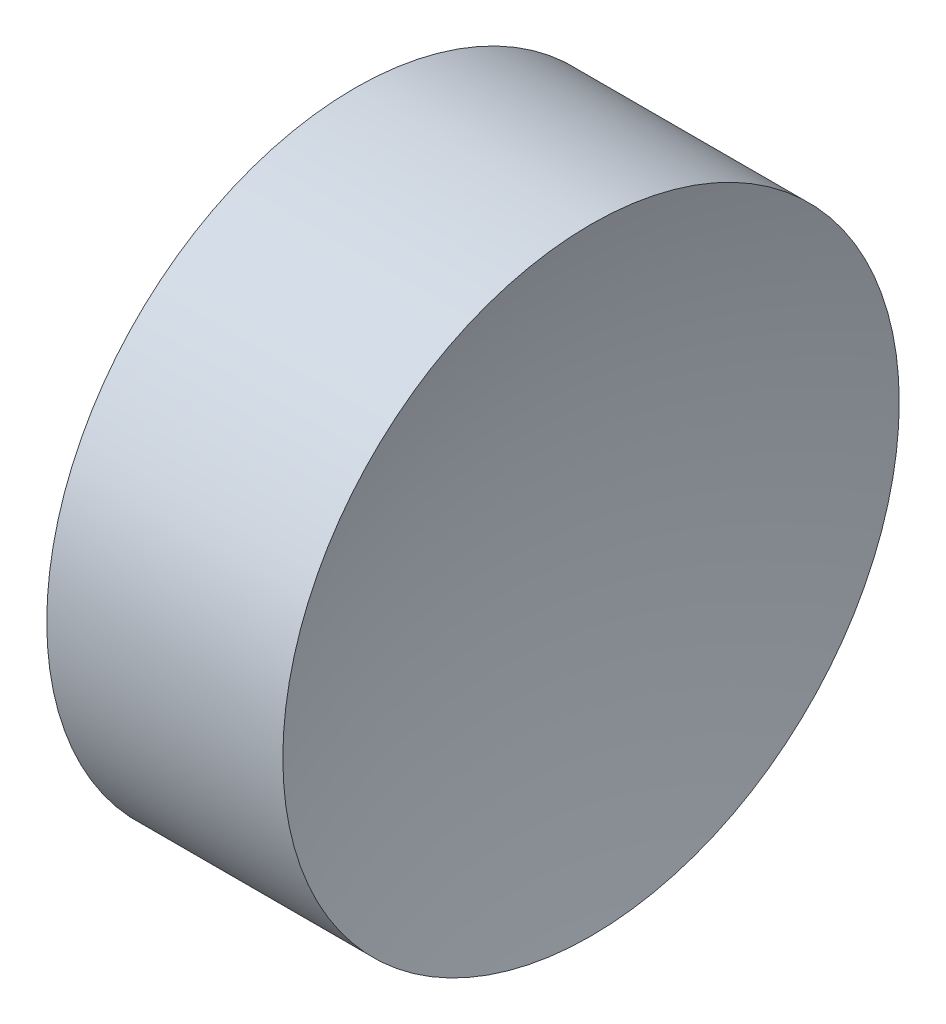
ISO-10303-21;
HEADER;
FILE_DESCRIPTION(('STEP AP214'),'2;1');
FILE_NAME('part.step','',(''),(''),'','','');
FILE_SCHEMA(('AUTOMOTIVE_DESIGN { 1 0 10303 214 1 1 1 1 }'));
ENDSEC;
DATA;
#1=APPLICATION_CONTEXT('core data for automotive mechanical design processes');
#2=APPLICATION_PROTOCOL_DEFINITION('international standard','automotive_design',2000,#1);
#3=PRODUCT_CONTEXT('',#1,'mechanical');
#4=PRODUCT('Part','Part','',(#3));
#5=PRODUCT_RELATED_PRODUCT_CATEGORY('part','',(#4));
#6=PRODUCT_DEFINITION_FORMATION('','',#4);
#7=PRODUCT_DEFINITION_CONTEXT('part definition',#1,'design');
#8=PRODUCT_DEFINITION('design','',#6,#7);
#9=PRODUCT_DEFINITION_SHAPE('','',#8);
#10=(LENGTH_UNIT() NAMED_UNIT(*) SI_UNIT(.MILLI.,.METRE.));
#11=(NAMED_UNIT(*) PLANE_ANGLE_UNIT() SI_UNIT($,.RADIAN.));
#12=(NAMED_UNIT(*) SI_UNIT($,.STERADIAN.) SOLID_ANGLE_UNIT());
#13=UNCERTAINTY_MEASURE_WITH_UNIT(LENGTH_MEASURE(1.E-05),#10,'distance_accuracy_value','');
#14=(GEOMETRIC_REPRESENTATION_CONTEXT(3) GLOBAL_UNCERTAINTY_ASSIGNED_CONTEXT((#13)) GLOBAL_UNIT_ASSIGNED_CONTEXT((#10,
#11,#12)) REPRESENTATION_CONTEXT('',''));
#15=CARTESIAN_POINT('',(0.,0.,0.));
#16=DIRECTION('',(0.,0.,1.));
#17=DIRECTION('',(1.,0.,0.));
#18=AXIS2_PLACEMENT_3D('',#15,#16,#17);
#19=CARTESIAN_POINT('',(24.44522198418,26.0890411491949,0.));
#20=DIRECTION('',(-1.,0.,0.));
#21=DIRECTION('',(0.,1.,0.));
#22=AXIS2_PLACEMENT_3D('',#19,#20,#21);
#23=SPHERICAL_SURFACE('',#22,22.1);
#24=CARTESIAN_POINT('',(45.6132993649909,26.089041149195,0.));
#25=DIRECTION('',(-1.,0.,0.));
#26=DIRECTION('',(0.,0.,1.));
#27=AXIS2_PLACEMENT_3D('',#24,#25,#26);
#28=CIRCLE('',#27,6.35);
#29=CARTESIAN_POINT('',(45.6132993649909,26.089041149195,6.35));
#30=VERTEX_POINT('',#29);
#31=EDGE_CURVE('E41',#30,#30,#28,.T.);
#32=ORIENTED_EDGE('',*,*,#31,.T.);
#33=EDGE_LOOP('',(#32));
#34=FACE_BOUND('',#33,.T.);
#35=ADVANCED_FACE('F35',(#34),#23,.F.);
#36=CARTESIAN_POINT('',(71.64522198418,26.089041149195,0.));
#37=DIRECTION('',(-1.,0.,0.));
#38=DIRECTION('',(0.,-1.,0.));
#39=AXIS2_PLACEMENT_3D('',#36,#37,#38);
#40=SPHERICAL_SURFACE('',#39,22.1);
#41=CARTESIAN_POINT('',(50.477144603369,26.089041149195,0.));
#42=DIRECTION('',(-1.,0.,0.));
#43=DIRECTION('',(0.,0.,1.));
#44=AXIS2_PLACEMENT_3D('',#41,#42,#43);
#45=CIRCLE('',#44,6.35);
#46=CARTESIAN_POINT('',(50.477144603369,26.089041149195,6.35));
#47=VERTEX_POINT('',#46);
#48=EDGE_CURVE('E10',#47,#47,#45,.T.);
#49=ORIENTED_EDGE('',*,*,#48,.F.);
#50=EDGE_LOOP('',(#49));
#51=FACE_BOUND('',#50,.T.);
#52=ADVANCED_FACE('F50',(#51),#40,.F.);
#53=CARTESIAN_POINT('',(42.4498611141368,26.089041149195,0.));
#54=DIRECTION('',(-1.,0.,0.));
#55=DIRECTION('',(0.,0.,1.));
#56=AXIS2_PLACEMENT_3D('',#53,#54,#55);
#57=CYLINDRICAL_SURFACE('',#56,6.35);
#58=ORIENTED_EDGE('',*,*,#31,.F.);
#59=EDGE_LOOP('',(#58));
#60=FACE_BOUND('',#59,.T.);
#61=ORIENTED_EDGE('',*,*,#48,.T.);
#62=EDGE_LOOP('',(#61));
#63=FACE_BOUND('',#62,.T.);
#64=ADVANCED_FACE('F48',(#60,#63),#57,.T.);
#65=CLOSED_SHELL('',(#35,#52,#64));
#66=MANIFOLD_SOLID_BREP('B2',#65);
#67=ADVANCED_BREP_SHAPE_REPRESENTATION('',(#18,#66),#14);
#68=SHAPE_DEFINITION_REPRESENTATION(#9,#67);
ENDSEC;
END-ISO-10303-21;
